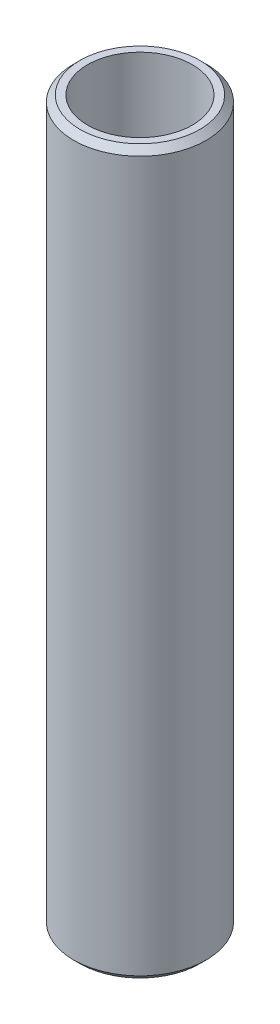
ISO-10303-21;
HEADER;
FILE_DESCRIPTION(('STEP AP214'),'2;1');
FILE_NAME('part.step','',(''),(''),'','','');
FILE_SCHEMA(('AUTOMOTIVE_DESIGN { 1 0 10303 214 1 1 1 1 }'));
ENDSEC;
DATA;
#1=APPLICATION_CONTEXT('core data for automotive mechanical design processes');
#2=APPLICATION_PROTOCOL_DEFINITION('international standard','automotive_design',2000,#1);
#3=PRODUCT_CONTEXT('',#1,'mechanical');
#4=PRODUCT('Part','Part','',(#3));
#5=PRODUCT_RELATED_PRODUCT_CATEGORY('part','',(#4));
#6=PRODUCT_DEFINITION_FORMATION('','',#4);
#7=PRODUCT_DEFINITION_CONTEXT('part definition',#1,'design');
#8=PRODUCT_DEFINITION('design','',#6,#7);
#9=PRODUCT_DEFINITION_SHAPE('','',#8);
#10=(LENGTH_UNIT() NAMED_UNIT(*) SI_UNIT(.MILLI.,.METRE.));
#11=(NAMED_UNIT(*) PLANE_ANGLE_UNIT() SI_UNIT($,.RADIAN.));
#12=(NAMED_UNIT(*) SI_UNIT($,.STERADIAN.) SOLID_ANGLE_UNIT());
#13=UNCERTAINTY_MEASURE_WITH_UNIT(LENGTH_MEASURE(1.E-05),#10,'distance_accuracy_value','');
#14=(GEOMETRIC_REPRESENTATION_CONTEXT(3) GLOBAL_UNCERTAINTY_ASSIGNED_CONTEXT((#13)) GLOBAL_UNIT_ASSIGNED_CONTEXT((#10,
#11,#12)) REPRESENTATION_CONTEXT('',''));
#15=CARTESIAN_POINT('',(0.,0.,0.));
#16=DIRECTION('',(0.,0.,1.));
#17=DIRECTION('',(1.,0.,0.));
#18=AXIS2_PLACEMENT_3D('',#15,#16,#17);
#19=CARTESIAN_POINT('',(0.,600.,0.));
#20=DIRECTION('',(0.,-1.,0.));
#21=DIRECTION('',(0.,0.,-1.));
#22=AXIS2_PLACEMENT_3D('',#19,#20,#21);
#23=CYLINDRICAL_SURFACE('',#22,55.);
#24=CARTESIAN_POINT('',(0.,594.738225537008,0.));
#25=DIRECTION('',(0.,1.,0.));
#26=DIRECTION('',(0.,0.,1.));
#27=AXIS2_PLACEMENT_3D('',#24,#25,#26);
#28=CIRCLE('',#27,55.);
#29=CARTESIAN_POINT('',(0.,594.738225537008,55.));
#30=VERTEX_POINT('',#29);
#31=EDGE_CURVE('E50',#30,#30,#28,.F.);
#32=ORIENTED_EDGE('',*,*,#31,.T.);
#33=EDGE_LOOP('',(#32));
#34=FACE_BOUND('',#33,.T.);
#35=CARTESIAN_POINT('',(0.,5.26177446299136,0.));
#36=DIRECTION('',(0.,1.,0.));
#37=DIRECTION('',(0.,0.,1.));
#38=AXIS2_PLACEMENT_3D('',#35,#36,#37);
#39=CIRCLE('',#38,55.);
#40=CARTESIAN_POINT('',(0.,5.26177446299136,55.));
#41=VERTEX_POINT('',#40);
#42=EDGE_CURVE('E51',#41,#41,#39,.T.);
#43=ORIENTED_EDGE('',*,*,#42,.T.);
#44=EDGE_LOOP('',(#43));
#45=FACE_BOUND('',#44,.T.);
#46=ADVANCED_FACE('F39',(#34,#45),#23,.T.);
#47=CARTESIAN_POINT('',(0.,600.,0.));
#48=DIRECTION('',(0.,1.,0.));
#49=DIRECTION('',(0.,0.,1.));
#50=AXIS2_PLACEMENT_3D('',#47,#48,#49);
#51=PLANE('',#50);
#52=CARTESIAN_POINT('',(0.,600.,0.));
#53=DIRECTION('',(0.,1.,0.));
#54=DIRECTION('',(0.,0.,1.));
#55=AXIS2_PLACEMENT_3D('',#52,#53,#54);
#56=CIRCLE('',#55,49.7382255370085);
#57=CARTESIAN_POINT('',(0.,600.,49.7382255370085));
#58=VERTEX_POINT('',#57);
#59=EDGE_CURVE('E54',#58,#58,#56,.T.);
#60=ORIENTED_EDGE('',*,*,#59,.T.);
#61=EDGE_LOOP('',(#60));
#62=FACE_BOUND('',#61,.T.);
#63=CARTESIAN_POINT('',(0.,600.,0.));
#64=DIRECTION('',(0.,1.,0.));
#65=DIRECTION('',(0.,0.,1.));
#66=AXIS2_PLACEMENT_3D('',#63,#64,#65);
#67=CIRCLE('',#66,43.5170660729616);
#68=CARTESIAN_POINT('',(0.,600.,43.5170660729616));
#69=VERTEX_POINT('',#68);
#70=EDGE_CURVE('E58',#69,#69,#67,.T.);
#71=ORIENTED_EDGE('',*,*,#70,.F.);
#72=EDGE_LOOP('',(#71));
#73=FACE_BOUND('',#72,.T.);
#74=ADVANCED_FACE('F69',(#62,#73),#51,.T.);
#75=CARTESIAN_POINT('',(0.,0.,0.));
#76=DIRECTION('',(0.,1.,0.));
#77=DIRECTION('',(0.,0.,1.));
#78=AXIS2_PLACEMENT_3D('',#75,#76,#77);
#79=PLANE('',#78);
#80=CARTESIAN_POINT('',(0.,0.,0.));
#81=DIRECTION('',(0.,1.,0.));
#82=DIRECTION('',(0.,0.,1.));
#83=AXIS2_PLACEMENT_3D('',#80,#81,#82);
#84=CIRCLE('',#83,49.7382255370086);
#85=CARTESIAN_POINT('',(0.,0.,49.7382255370086));
#86=VERTEX_POINT('',#85);
#87=EDGE_CURVE('E10',#86,#86,#84,.F.);
#88=ORIENTED_EDGE('',*,*,#87,.T.);
#89=EDGE_LOOP('',(#88));
#90=FACE_BOUND('',#89,.T.);
#91=CARTESIAN_POINT('',(0.,0.,0.));
#92=DIRECTION('',(0.,1.,0.));
#93=DIRECTION('',(0.,0.,1.));
#94=AXIS2_PLACEMENT_3D('',#91,#92,#93);
#95=CIRCLE('',#94,43.5170660729616);
#96=CARTESIAN_POINT('',(0.,0.,43.5170660729616));
#97=VERTEX_POINT('',#96);
#98=EDGE_CURVE('E63',#97,#97,#95,.T.);
#99=ORIENTED_EDGE('',*,*,#98,.T.);
#100=EDGE_LOOP('',(#99));
#101=FACE_BOUND('',#100,.T.);
#102=ADVANCED_FACE('F75',(#90,#101),#79,.F.);
#103=CARTESIAN_POINT('',(0.,600.,0.));
#104=DIRECTION('',(0.,-1.,0.));
#105=DIRECTION('',(0.,0.,-1.));
#106=AXIS2_PLACEMENT_3D('',#103,#104,#105);
#107=CYLINDRICAL_SURFACE('',#106,43.5170660729616);
#108=ORIENTED_EDGE('',*,*,#70,.T.);
#109=EDGE_LOOP('',(#108));
#110=FACE_BOUND('',#109,.T.);
#111=ORIENTED_EDGE('',*,*,#98,.F.);
#112=EDGE_LOOP('',(#111));
#113=FACE_BOUND('',#112,.T.);
#114=ADVANCED_FACE('F70',(#110,#113),#107,.F.);
#115=CARTESIAN_POINT('',(0.,600.,0.));
#116=DIRECTION('',(0.,-1.,0.));
#117=DIRECTION('',(0.,0.,-1.));
#118=AXIS2_PLACEMENT_3D('',#115,#116,#117);
#119=CONICAL_SURFACE('',#118,49.7382255370085,0.785398163397439);
#120=ORIENTED_EDGE('',*,*,#31,.F.);
#121=EDGE_LOOP('',(#120));
#122=FACE_BOUND('',#121,.T.);
#123=ORIENTED_EDGE('',*,*,#59,.F.);
#124=EDGE_LOOP('',(#123));
#125=FACE_BOUND('',#124,.T.);
#126=ADVANCED_FACE('F81',(#122,#125),#119,.T.);
#127=CARTESIAN_POINT('',(0.,5.26177446299136,0.));
#128=DIRECTION('',(0.,1.,0.));
#129=DIRECTION('',(0.,0.,1.));
#130=AXIS2_PLACEMENT_3D('',#127,#128,#129);
#131=CONICAL_SURFACE('',#130,55.,0.785398163397454);
#132=ORIENTED_EDGE('',*,*,#87,.F.);
#133=EDGE_LOOP('',(#132));
#134=FACE_BOUND('',#133,.T.);
#135=ORIENTED_EDGE('',*,*,#42,.F.);
#136=EDGE_LOOP('',(#135));
#137=FACE_BOUND('',#136,.T.);
#138=ADVANCED_FACE('F45',(#134,#137),#131,.T.);
#139=CLOSED_SHELL('',(#46,#74,#102,#114,#126,#138));
#140=MANIFOLD_SOLID_BREP('B2',#139);
#141=ADVANCED_BREP_SHAPE_REPRESENTATION('',(#18,#140),#14);
#142=SHAPE_DEFINITION_REPRESENTATION(#9,#141);
ENDSEC;
END-ISO-10303-21;
